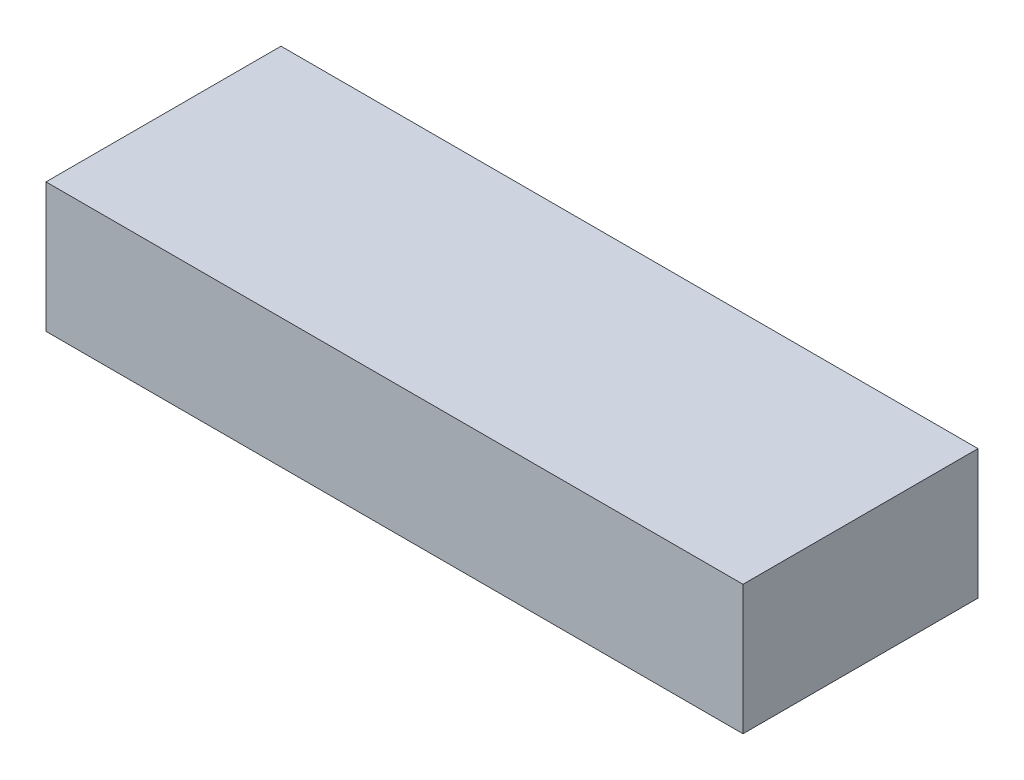
ISO-10303-21;
HEADER;
FILE_DESCRIPTION(('STEP AP214'),'2;1');
FILE_NAME('part.step','',(''),(''),'','','');
FILE_SCHEMA(('AUTOMOTIVE_DESIGN { 1 0 10303 214 1 1 1 1 }'));
ENDSEC;
DATA;
#1=APPLICATION_CONTEXT('core data for automotive mechanical design processes');
#2=APPLICATION_PROTOCOL_DEFINITION('international standard','automotive_design',2000,#1);
#3=PRODUCT_CONTEXT('',#1,'mechanical');
#4=PRODUCT('Part','Part','',(#3));
#5=PRODUCT_RELATED_PRODUCT_CATEGORY('part','',(#4));
#6=PRODUCT_DEFINITION_FORMATION('','',#4);
#7=PRODUCT_DEFINITION_CONTEXT('part definition',#1,'design');
#8=PRODUCT_DEFINITION('design','',#6,#7);
#9=PRODUCT_DEFINITION_SHAPE('','',#8);
#10=(LENGTH_UNIT() NAMED_UNIT(*) SI_UNIT(.MILLI.,.METRE.));
#11=(NAMED_UNIT(*) PLANE_ANGLE_UNIT() SI_UNIT($,.RADIAN.));
#12=(NAMED_UNIT(*) SI_UNIT($,.STERADIAN.) SOLID_ANGLE_UNIT());
#13=UNCERTAINTY_MEASURE_WITH_UNIT(LENGTH_MEASURE(1.E-05),#10,'distance_accuracy_value','');
#14=(GEOMETRIC_REPRESENTATION_CONTEXT(3) GLOBAL_UNCERTAINTY_ASSIGNED_CONTEXT((#13)) GLOBAL_UNIT_ASSIGNED_CONTEXT((#10,
#11,#12)) REPRESENTATION_CONTEXT('',''));
#15=CARTESIAN_POINT('',(0.,0.,0.));
#16=DIRECTION('',(0.,0.,1.));
#17=DIRECTION('',(1.,0.,0.));
#18=AXIS2_PLACEMENT_3D('',#15,#16,#17);
#19=CARTESIAN_POINT('',(-0.74000106,0.13750036,0.49899824));
#20=DIRECTION('',(0.,0.,1.));
#21=DIRECTION('',(1.,0.,0.));
#22=AXIS2_PLACEMENT_3D('',#19,#20,#21);
#23=PLANE('',#22);
#24=DIRECTION('',(1.,0.,0.));
#25=VECTOR('',#24,1.);
#26=CARTESIAN_POINT('',(-0.74000106,0.13750036,0.49899824));
#27=LINE('',#26,#25);
#28=CARTESIAN_POINT('',(-0.74000106,0.13750036,0.49899824));
#29=VERTEX_POINT('',#28);
#30=CARTESIAN_POINT('',(0.74000106,0.13750036,0.49899824));
#31=VERTEX_POINT('',#30);
#32=EDGE_CURVE('E101',#29,#31,#27,.T.);
#33=ORIENTED_EDGE('',*,*,#32,.F.);
#34=DIRECTION('',(0.,1.,0.));
#35=VECTOR('',#34,1.);
#36=CARTESIAN_POINT('',(-0.74000106,-0.13750036,0.49899824));
#37=LINE('',#36,#35);
#38=CARTESIAN_POINT('',(-0.74000106,-0.13750036,0.49899824));
#39=VERTEX_POINT('',#38);
#40=EDGE_CURVE('E27',#39,#29,#37,.T.);
#41=ORIENTED_EDGE('',*,*,#40,.F.);
#42=DIRECTION('',(-1.,0.,0.));
#43=VECTOR('',#42,1.);
#44=CARTESIAN_POINT('',(0.74000106,-0.13750036,0.49899824));
#45=LINE('',#44,#43);
#46=CARTESIAN_POINT('',(0.74000106,-0.13750036,0.49899824));
#47=VERTEX_POINT('',#46);
#48=EDGE_CURVE('E83',#47,#39,#45,.T.);
#49=ORIENTED_EDGE('',*,*,#48,.F.);
#50=DIRECTION('',(0.,-1.,0.));
#51=VECTOR('',#50,1.);
#52=CARTESIAN_POINT('',(0.74000106,0.13750036,0.49899824));
#53=LINE('',#52,#51);
#54=EDGE_CURVE('E86',#31,#47,#53,.T.);
#55=ORIENTED_EDGE('',*,*,#54,.F.);
#56=EDGE_LOOP('',(#33,#41,#49,#55));
#57=FACE_BOUND('',#56,.T.);
#58=ADVANCED_FACE('F17',(#57),#23,.T.);
#59=CARTESIAN_POINT('',(-0.74000106,0.13750036,0.));
#60=DIRECTION('',(0.,0.,1.));
#61=DIRECTION('',(1.,0.,0.));
#62=AXIS2_PLACEMENT_3D('',#59,#60,#61);
#63=PLANE('',#62);
#64=DIRECTION('',(1.,0.,0.));
#65=VECTOR('',#64,1.);
#66=CARTESIAN_POINT('',(-0.74000106,0.13750036,0.));
#67=LINE('',#66,#65);
#68=CARTESIAN_POINT('',(-0.74000106,0.13750036,0.));
#69=VERTEX_POINT('',#68);
#70=CARTESIAN_POINT('',(0.74000106,0.13750036,0.));
#71=VERTEX_POINT('',#70);
#72=EDGE_CURVE('E78',#69,#71,#67,.T.);
#73=ORIENTED_EDGE('',*,*,#72,.T.);
#74=DIRECTION('',(0.,-1.,0.));
#75=VECTOR('',#74,1.);
#76=CARTESIAN_POINT('',(0.74000106,0.13750036,0.));
#77=LINE('',#76,#75);
#78=CARTESIAN_POINT('',(0.74000106,-0.13750036,0.));
#79=VERTEX_POINT('',#78);
#80=EDGE_CURVE('E75',#71,#79,#77,.T.);
#81=ORIENTED_EDGE('',*,*,#80,.T.);
#82=DIRECTION('',(-1.,0.,0.));
#83=VECTOR('',#82,1.);
#84=CARTESIAN_POINT('',(0.74000106,-0.13750036,0.));
#85=LINE('',#84,#83);
#86=CARTESIAN_POINT('',(-0.74000106,-0.13750036,0.));
#87=VERTEX_POINT('',#86);
#88=EDGE_CURVE('E64',#79,#87,#85,.T.);
#89=ORIENTED_EDGE('',*,*,#88,.T.);
#90=DIRECTION('',(0.,1.,0.));
#91=VECTOR('',#90,1.);
#92=CARTESIAN_POINT('',(-0.74000106,-0.13750036,0.));
#93=LINE('',#92,#91);
#94=EDGE_CURVE('E11',#87,#69,#93,.T.);
#95=ORIENTED_EDGE('',*,*,#94,.T.);
#96=EDGE_LOOP('',(#73,#81,#89,#95));
#97=FACE_BOUND('',#96,.T.);
#98=ADVANCED_FACE('F76',(#97),#63,.F.);
#99=CARTESIAN_POINT('',(-0.74000106,-0.13750036,0.));
#100=DIRECTION('',(-1.,0.,0.));
#101=DIRECTION('',(0.,0.,1.));
#102=AXIS2_PLACEMENT_3D('',#99,#100,#101);
#103=PLANE('',#102);
#104=DIRECTION('',(0.,0.,1.));
#105=VECTOR('',#104,1.);
#106=CARTESIAN_POINT('',(-0.74000106,-0.13750036,0.));
#107=LINE('',#106,#105);
#108=EDGE_CURVE('E71',#87,#39,#107,.T.);
#109=ORIENTED_EDGE('',*,*,#108,.T.);
#110=ORIENTED_EDGE('',*,*,#40,.T.);
#111=DIRECTION('',(0.,0.,1.));
#112=VECTOR('',#111,1.);
#113=CARTESIAN_POINT('',(-0.74000106,0.13750036,0.));
#114=LINE('',#113,#112);
#115=EDGE_CURVE('E105',#69,#29,#114,.T.);
#116=ORIENTED_EDGE('',*,*,#115,.F.);
#117=ORIENTED_EDGE('',*,*,#94,.F.);
#118=EDGE_LOOP('',(#109,#110,#116,#117));
#119=FACE_BOUND('',#118,.T.);
#120=ADVANCED_FACE('F114',(#119),#103,.T.);
#121=CARTESIAN_POINT('',(0.74000106,-0.13750036,0.));
#122=DIRECTION('',(0.,-1.,0.));
#123=DIRECTION('',(0.,0.,-1.));
#124=AXIS2_PLACEMENT_3D('',#121,#122,#123);
#125=PLANE('',#124);
#126=DIRECTION('',(0.,0.,1.));
#127=VECTOR('',#126,1.);
#128=CARTESIAN_POINT('',(0.74000106,-0.13750036,0.));
#129=LINE('',#128,#127);
#130=EDGE_CURVE('E69',#79,#47,#129,.T.);
#131=ORIENTED_EDGE('',*,*,#130,.T.);
#132=ORIENTED_EDGE('',*,*,#48,.T.);
#133=ORIENTED_EDGE('',*,*,#108,.F.);
#134=ORIENTED_EDGE('',*,*,#88,.F.);
#135=EDGE_LOOP('',(#131,#132,#133,#134));
#136=FACE_BOUND('',#135,.T.);
#137=ADVANCED_FACE('F66',(#136),#125,.T.);
#138=CARTESIAN_POINT('',(0.74000106,0.13750036,0.));
#139=DIRECTION('',(1.,0.,0.));
#140=DIRECTION('',(0.,1.,0.));
#141=AXIS2_PLACEMENT_3D('',#138,#139,#140);
#142=PLANE('',#141);
#143=DIRECTION('',(0.,0.,1.));
#144=VECTOR('',#143,1.);
#145=CARTESIAN_POINT('',(0.74000106,0.13750036,0.));
#146=LINE('',#145,#144);
#147=EDGE_CURVE('E104',#71,#31,#146,.T.);
#148=ORIENTED_EDGE('',*,*,#147,.T.);
#149=ORIENTED_EDGE('',*,*,#54,.T.);
#150=ORIENTED_EDGE('',*,*,#130,.F.);
#151=ORIENTED_EDGE('',*,*,#80,.F.);
#152=EDGE_LOOP('',(#148,#149,#150,#151));
#153=FACE_BOUND('',#152,.T.);
#154=ADVANCED_FACE('F19',(#153),#142,.T.);
#155=CARTESIAN_POINT('',(-0.74000106,0.13750036,0.));
#156=DIRECTION('',(0.,1.,0.));
#157=DIRECTION('',(1.,0.,0.));
#158=AXIS2_PLACEMENT_3D('',#155,#156,#157);
#159=PLANE('',#158);
#160=ORIENTED_EDGE('',*,*,#115,.T.);
#161=ORIENTED_EDGE('',*,*,#32,.T.);
#162=ORIENTED_EDGE('',*,*,#147,.F.);
#163=ORIENTED_EDGE('',*,*,#72,.F.);
#164=EDGE_LOOP('',(#160,#161,#162,#163));
#165=FACE_BOUND('',#164,.T.);
#166=ADVANCED_FACE('F112',(#165),#159,.T.);
#167=CLOSED_SHELL('',(#58,#98,#120,#137,#154,#166));
#168=MANIFOLD_SOLID_BREP('B1',#167);
#169=ADVANCED_BREP_SHAPE_REPRESENTATION('',(#18,#168),#14);
#170=SHAPE_DEFINITION_REPRESENTATION(#9,#169);
ENDSEC;
END-ISO-10303-21;
